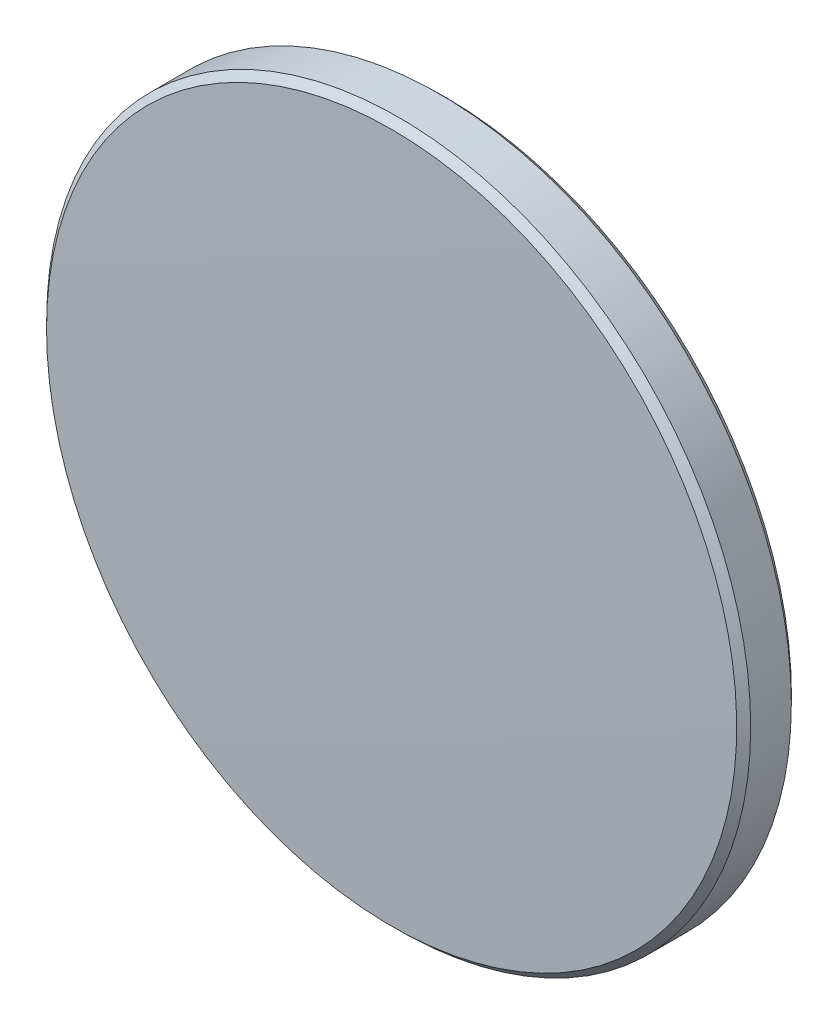
ISO-10303-21;
HEADER;
FILE_DESCRIPTION(('STEP AP214'),'2;1');
FILE_NAME('part.step','',(''),(''),'','','');
FILE_SCHEMA(('AUTOMOTIVE_DESIGN { 1 0 10303 214 1 1 1 1 }'));
ENDSEC;
DATA;
#1=APPLICATION_CONTEXT('core data for automotive mechanical design processes');
#2=APPLICATION_PROTOCOL_DEFINITION('international standard','automotive_design',2000,#1);
#3=PRODUCT_CONTEXT('',#1,'mechanical');
#4=PRODUCT('Part','Part','',(#3));
#5=PRODUCT_RELATED_PRODUCT_CATEGORY('part','',(#4));
#6=PRODUCT_DEFINITION_FORMATION('','',#4);
#7=PRODUCT_DEFINITION_CONTEXT('part definition',#1,'design');
#8=PRODUCT_DEFINITION('design','',#6,#7);
#9=PRODUCT_DEFINITION_SHAPE('','',#8);
#10=(LENGTH_UNIT() NAMED_UNIT(*) SI_UNIT(.MILLI.,.METRE.));
#11=(NAMED_UNIT(*) PLANE_ANGLE_UNIT() SI_UNIT($,.RADIAN.));
#12=(NAMED_UNIT(*) SI_UNIT($,.STERADIAN.) SOLID_ANGLE_UNIT());
#13=UNCERTAINTY_MEASURE_WITH_UNIT(LENGTH_MEASURE(1.E-05),#10,'distance_accuracy_value','');
#14=(GEOMETRIC_REPRESENTATION_CONTEXT(3) GLOBAL_UNCERTAINTY_ASSIGNED_CONTEXT((#13)) GLOBAL_UNIT_ASSIGNED_CONTEXT((#10,
#11,#12)) REPRESENTATION_CONTEXT('',''));
#15=CARTESIAN_POINT('',(0.,0.,0.));
#16=DIRECTION('',(0.,0.,1.));
#17=DIRECTION('',(1.,0.,0.));
#18=AXIS2_PLACEMENT_3D('',#15,#16,#17);
#19=CARTESIAN_POINT('',(0.,0.,-688.7));
#20=DIRECTION('',(0.,0.,1.));
#21=DIRECTION('',(0.,1.,0.));
#22=AXIS2_PLACEMENT_3D('',#19,#20,#21);
#23=SPHERICAL_SURFACE('',#22,689.8);
#24=CARTESIAN_POINT('',(0.,0.,0.987636047820595));
#25=DIRECTION('',(0.,0.,-1.));
#26=DIRECTION('',(-1.,0.,0.));
#27=AXIS2_PLACEMENT_3D('',#24,#25,#26);
#28=CIRCLE('',#27,12.4500876610932);
#29=CARTESIAN_POINT('',(-12.4500876610932,0.,0.987636047820595));
#30=VERTEX_POINT('',#29);
#31=EDGE_CURVE('E9',#30,#30,#28,.F.);
#32=ORIENTED_EDGE('',*,*,#31,.T.);
#33=EDGE_LOOP('',(#32));
#34=FACE_BOUND('',#33,.T.);
#35=ADVANCED_FACE('F13',(#34),#23,.T.);
#36=CARTESIAN_POINT('',(0.,0.,1.1));
#37=DIRECTION('',(0.,0.,1.));
#38=DIRECTION('',(1.,0.,0.));
#39=AXIS2_PLACEMENT_3D('',#36,#37,#38);
#40=CYLINDRICAL_SURFACE('',#39,12.7);
#41=CARTESIAN_POINT('',(0.,0.,-0.733079392266967));
#42=DIRECTION('',(0.,0.,1.));
#43=DIRECTION('',(1.,0.,0.));
#44=AXIS2_PLACEMENT_3D('',#41,#42,#43);
#45=CIRCLE('',#44,12.7);
#46=CARTESIAN_POINT('',(12.7,0.,-0.733079392266967));
#47=VERTEX_POINT('',#46);
#48=EDGE_CURVE('E24',#47,#47,#45,.T.);
#49=ORIENTED_EDGE('',*,*,#48,.T.);
#50=EDGE_LOOP('',(#49));
#51=FACE_BOUND('',#50,.T.);
#52=CARTESIAN_POINT('',(0.,0.,0.733079392266967));
#53=DIRECTION('',(0.,0.,-1.));
#54=DIRECTION('',(-1.,0.,0.));
#55=AXIS2_PLACEMENT_3D('',#52,#53,#54);
#56=CIRCLE('',#55,12.7);
#57=CARTESIAN_POINT('',(-12.7,0.,0.733079392266967));
#58=VERTEX_POINT('',#57);
#59=EDGE_CURVE('E28',#58,#58,#56,.T.);
#60=ORIENTED_EDGE('',*,*,#59,.T.);
#61=EDGE_LOOP('',(#60));
#62=FACE_BOUND('',#61,.T.);
#63=ADVANCED_FACE('F34',(#51,#62),#40,.T.);
#64=CARTESIAN_POINT('',(0.,0.,688.7));
#65=DIRECTION('',(0.,0.,1.));
#66=DIRECTION('',(0.,1.,0.));
#67=AXIS2_PLACEMENT_3D('',#64,#65,#66);
#68=SPHERICAL_SURFACE('',#67,689.8);
#69=CARTESIAN_POINT('',(0.,0.,-0.987636047820595));
#70=DIRECTION('',(0.,0.,1.));
#71=DIRECTION('',(1.,0.,0.));
#72=AXIS2_PLACEMENT_3D('',#69,#70,#71);
#73=CIRCLE('',#72,12.4500876610933);
#74=CARTESIAN_POINT('',(12.4500876610933,0.,-0.987636047820595));
#75=VERTEX_POINT('',#74);
#76=EDGE_CURVE('E20',#75,#75,#73,.F.);
#77=ORIENTED_EDGE('',*,*,#76,.T.);
#78=EDGE_LOOP('',(#77));
#79=FACE_BOUND('',#78,.T.);
#80=ADVANCED_FACE('F43',(#79),#68,.T.);
#81=CARTESIAN_POINT('',(0.,0.,-0.733079392266967));
#82=DIRECTION('',(0.,0.,1.));
#83=DIRECTION('',(1.,0.,0.));
#84=AXIS2_PLACEMENT_3D('',#81,#82,#83);
#85=CONICAL_SURFACE('',#84,12.7,0.776192076418715);
#86=ORIENTED_EDGE('',*,*,#76,.F.);
#87=EDGE_LOOP('',(#86));
#88=FACE_BOUND('',#87,.T.);
#89=ORIENTED_EDGE('',*,*,#48,.F.);
#90=EDGE_LOOP('',(#89));
#91=FACE_BOUND('',#90,.T.);
#92=ADVANCED_FACE('F38',(#88,#91),#85,.T.);
#93=CARTESIAN_POINT('',(0.,0.,0.987636047820595));
#94=DIRECTION('',(0.,0.,-1.));
#95=DIRECTION('',(-1.,0.,0.));
#96=AXIS2_PLACEMENT_3D('',#93,#94,#95);
#97=CONICAL_SURFACE('',#96,12.4500876610932,0.776192076418836);
#98=ORIENTED_EDGE('',*,*,#59,.F.);
#99=EDGE_LOOP('',(#98));
#100=FACE_BOUND('',#99,.T.);
#101=ORIENTED_EDGE('',*,*,#31,.F.);
#102=EDGE_LOOP('',(#101));
#103=FACE_BOUND('',#102,.T.);
#104=ADVANCED_FACE('F15',(#100,#103),#97,.T.);
#105=CLOSED_SHELL('',(#35,#63,#80,#92,#104));
#106=MANIFOLD_SOLID_BREP('B1',#105);
#107=ADVANCED_BREP_SHAPE_REPRESENTATION('',(#18,#106),#14);
#108=SHAPE_DEFINITION_REPRESENTATION(#9,#107);
ENDSEC;
END-ISO-10303-21;
